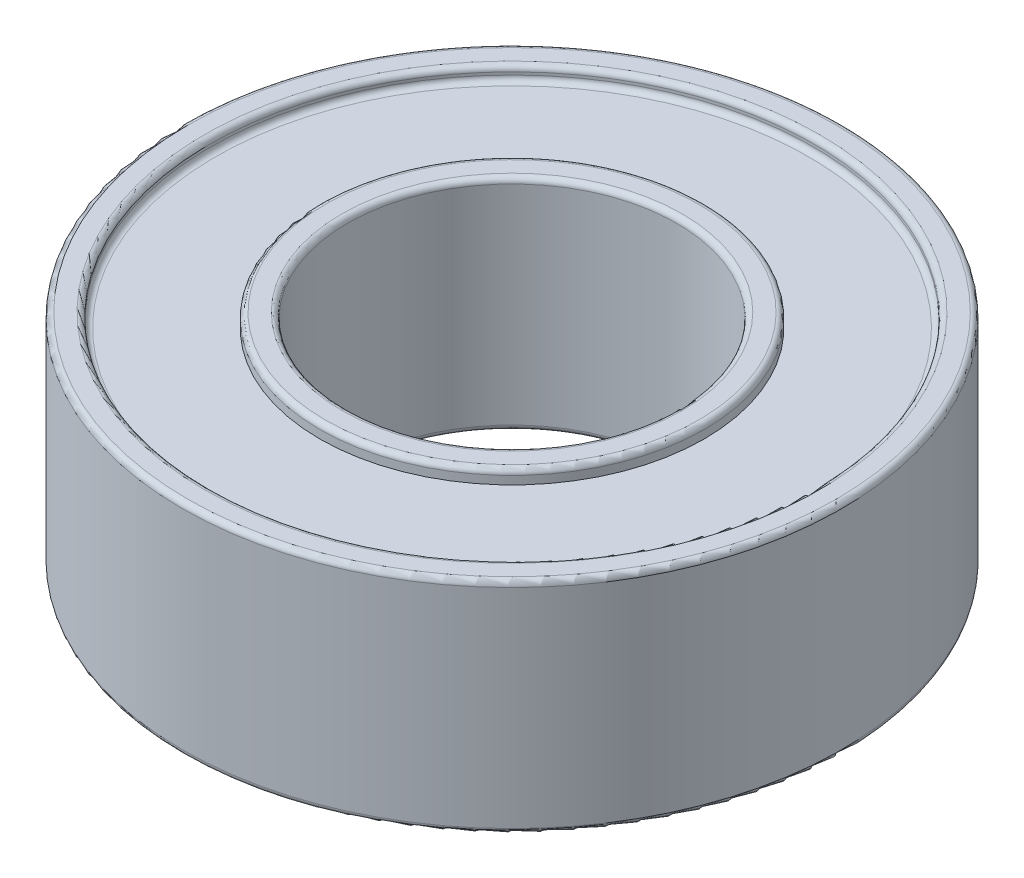
ISO-10303-21;
HEADER;
FILE_DESCRIPTION(('STEP AP214'),'2;1');
FILE_NAME('part.step','',(''),(''),'','','');
FILE_SCHEMA(('AUTOMOTIVE_DESIGN { 1 0 10303 214 1 1 1 1 }'));
ENDSEC;
DATA;
#1=APPLICATION_CONTEXT('core data for automotive mechanical design processes');
#2=APPLICATION_PROTOCOL_DEFINITION('international standard','automotive_design',2000,#1);
#3=PRODUCT_CONTEXT('',#1,'mechanical');
#4=PRODUCT('Part','Part','',(#3));
#5=PRODUCT_RELATED_PRODUCT_CATEGORY('part','',(#4));
#6=PRODUCT_DEFINITION_FORMATION('','',#4);
#7=PRODUCT_DEFINITION_CONTEXT('part definition',#1,'design');
#8=PRODUCT_DEFINITION('design','',#6,#7);
#9=PRODUCT_DEFINITION_SHAPE('','',#8);
#10=(LENGTH_UNIT() NAMED_UNIT(*) SI_UNIT(.MILLI.,.METRE.));
#11=(NAMED_UNIT(*) PLANE_ANGLE_UNIT() SI_UNIT($,.RADIAN.));
#12=(NAMED_UNIT(*) SI_UNIT($,.STERADIAN.) SOLID_ANGLE_UNIT());
#13=UNCERTAINTY_MEASURE_WITH_UNIT(LENGTH_MEASURE(1.E-05),#10,'distance_accuracy_value','');
#14=(GEOMETRIC_REPRESENTATION_CONTEXT(3) GLOBAL_UNCERTAINTY_ASSIGNED_CONTEXT((#13)) GLOBAL_UNIT_ASSIGNED_CONTEXT((#10,
#11,#12)) REPRESENTATION_CONTEXT('',''));
#15=CARTESIAN_POINT('',(0.,0.,0.));
#16=DIRECTION('',(0.,0.,1.));
#17=DIRECTION('',(1.,0.,0.));
#18=AXIS2_PLACEMENT_3D('',#15,#16,#17);
#19=CARTESIAN_POINT('',(0.,0.,0.));
#20=DIRECTION('',(0.,1.,0.));
#21=DIRECTION('',(0.,0.,1.));
#22=AXIS2_PLACEMENT_3D('',#19,#20,#21);
#23=PLANE('',#22);
#24=CARTESIAN_POINT('',(0.,0.,0.));
#25=DIRECTION('',(0.,1.,0.));
#26=DIRECTION('',(0.,0.,1.));
#27=AXIS2_PLACEMENT_3D('',#24,#25,#26);
#28=CIRCLE('',#27,3.1);
#29=CARTESIAN_POINT('',(0.,0.,3.1));
#30=VERTEX_POINT('',#29);
#31=EDGE_CURVE('E75',#30,#30,#28,.T.);
#32=ORIENTED_EDGE('',*,*,#31,.T.);
#33=EDGE_LOOP('',(#32));
#34=FACE_BOUND('',#33,.T.);
#35=CARTESIAN_POINT('',(0.,0.,0.));
#36=DIRECTION('',(0.,1.,0.));
#37=DIRECTION('',(0.,0.,1.));
#38=AXIS2_PLACEMENT_3D('',#35,#36,#37);
#39=CIRCLE('',#38,3.4);
#40=CARTESIAN_POINT('',(0.,0.,3.4));
#41=VERTEX_POINT('',#40);
#42=EDGE_CURVE('E78',#41,#41,#39,.F.);
#43=ORIENTED_EDGE('',*,*,#42,.T.);
#44=EDGE_LOOP('',(#43));
#45=FACE_BOUND('',#44,.T.);
#46=ADVANCED_FACE('F34',(#34,#45),#23,.F.);
#47=CARTESIAN_POINT('',(0.,4.,0.));
#48=DIRECTION('',(0.,1.,0.));
#49=DIRECTION('',(0.,0.,1.));
#50=AXIS2_PLACEMENT_3D('',#47,#48,#49);
#51=PLANE('',#50);
#52=CARTESIAN_POINT('',(0.,4.,0.));
#53=DIRECTION('',(0.,1.,0.));
#54=DIRECTION('',(0.,0.,1.));
#55=AXIS2_PLACEMENT_3D('',#52,#53,#54);
#56=CIRCLE('',#55,3.4);
#57=CARTESIAN_POINT('',(0.,4.,3.4));
#58=VERTEX_POINT('',#57);
#59=EDGE_CURVE('E60',#58,#58,#56,.T.);
#60=ORIENTED_EDGE('',*,*,#59,.T.);
#61=EDGE_LOOP('',(#60));
#62=FACE_BOUND('',#61,.T.);
#63=CARTESIAN_POINT('',(0.,4.,0.));
#64=DIRECTION('',(0.,1.,0.));
#65=DIRECTION('',(0.,0.,1.));
#66=AXIS2_PLACEMENT_3D('',#63,#64,#65);
#67=CIRCLE('',#66,3.1);
#68=CARTESIAN_POINT('',(0.,4.,3.1));
#69=VERTEX_POINT('',#68);
#70=EDGE_CURVE('E63',#69,#69,#67,.F.);
#71=ORIENTED_EDGE('',*,*,#70,.T.);
#72=EDGE_LOOP('',(#71));
#73=FACE_BOUND('',#72,.T.);
#74=ADVANCED_FACE('F124',(#62,#73),#51,.T.);
#75=CARTESIAN_POINT('',(0.,4.,0.));
#76=DIRECTION('',(0.,1.,0.));
#77=DIRECTION('',(0.,0.,1.));
#78=AXIS2_PLACEMENT_3D('',#75,#76,#77);
#79=CIRCLE('',#78,5.6);
#80=CARTESIAN_POINT('',(0.,4.,5.6));
#81=VERTEX_POINT('',#80);
#82=EDGE_CURVE('E84',#81,#81,#79,.F.);
#83=ORIENTED_EDGE('',*,*,#82,.T.);
#84=EDGE_LOOP('',(#83));
#85=FACE_BOUND('',#84,.T.);
#86=CARTESIAN_POINT('',(0.,4.,0.));
#87=DIRECTION('',(0.,1.,0.));
#88=DIRECTION('',(0.,0.,1.));
#89=AXIS2_PLACEMENT_3D('',#86,#87,#88);
#90=CIRCLE('',#89,5.9);
#91=CARTESIAN_POINT('',(0.,4.,5.9));
#92=VERTEX_POINT('',#91);
#93=EDGE_CURVE('E87',#92,#92,#90,.T.);
#94=ORIENTED_EDGE('',*,*,#93,.T.);
#95=EDGE_LOOP('',(#94));
#96=FACE_BOUND('',#95,.T.);
#97=ADVANCED_FACE('F131',(#85,#96),#51,.T.);
#98=CARTESIAN_POINT('',(0.,0.,0.));
#99=DIRECTION('',(0.,1.,0.));
#100=DIRECTION('',(0.,0.,1.));
#101=AXIS2_PLACEMENT_3D('',#98,#99,#100);
#102=CIRCLE('',#101,5.9);
#103=CARTESIAN_POINT('',(0.,0.,5.9));
#104=VERTEX_POINT('',#103);
#105=EDGE_CURVE('E45',#104,#104,#102,.F.);
#106=ORIENTED_EDGE('',*,*,#105,.T.);
#107=EDGE_LOOP('',(#106));
#108=FACE_BOUND('',#107,.T.);
#109=CARTESIAN_POINT('',(0.,0.,0.));
#110=DIRECTION('',(0.,1.,0.));
#111=DIRECTION('',(0.,0.,1.));
#112=AXIS2_PLACEMENT_3D('',#109,#110,#111);
#113=CIRCLE('',#112,5.5);
#114=CARTESIAN_POINT('',(0.,0.,5.5));
#115=VERTEX_POINT('',#114);
#116=EDGE_CURVE('E99',#115,#115,#113,.T.);
#117=ORIENTED_EDGE('',*,*,#116,.T.);
#118=EDGE_LOOP('',(#117));
#119=FACE_BOUND('',#118,.T.);
#120=ADVANCED_FACE('F127',(#108,#119),#23,.F.);
#121=CARTESIAN_POINT('',(0.,4.,0.));
#122=DIRECTION('',(0.,-1.,0.));
#123=DIRECTION('',(0.,0.,-1.));
#124=AXIS2_PLACEMENT_3D('',#121,#122,#123);
#125=CYLINDRICAL_SURFACE('',#124,6.);
#126=CARTESIAN_POINT('',(0.,0.0999999999999998,0.));
#127=DIRECTION('',(0.,1.,0.));
#128=DIRECTION('',(0.,0.,1.));
#129=AXIS2_PLACEMENT_3D('',#126,#127,#128);
#130=CIRCLE('',#129,6.);
#131=CARTESIAN_POINT('',(0.,0.0999999999999998,6.));
#132=VERTEX_POINT('',#131);
#133=EDGE_CURVE('E49',#132,#132,#130,.T.);
#134=ORIENTED_EDGE('',*,*,#133,.T.);
#135=EDGE_LOOP('',(#134));
#136=FACE_BOUND('',#135,.T.);
#137=CARTESIAN_POINT('',(0.,3.9,0.));
#138=DIRECTION('',(0.,1.,0.));
#139=DIRECTION('',(0.,0.,1.));
#140=AXIS2_PLACEMENT_3D('',#137,#138,#139);
#141=CIRCLE('',#140,6.);
#142=CARTESIAN_POINT('',(0.,3.9,6.));
#143=VERTEX_POINT('',#142);
#144=EDGE_CURVE('E54',#143,#143,#141,.F.);
#145=ORIENTED_EDGE('',*,*,#144,.T.);
#146=EDGE_LOOP('',(#145));
#147=FACE_BOUND('',#146,.T.);
#148=ADVANCED_FACE('F137',(#136,#147),#125,.T.);
#149=CARTESIAN_POINT('',(0.,4.,0.));
#150=DIRECTION('',(0.,-1.,0.));
#151=DIRECTION('',(0.,0.,-1.));
#152=AXIS2_PLACEMENT_3D('',#149,#150,#151);
#153=CYLINDRICAL_SURFACE('',#152,3.);
#154=CARTESIAN_POINT('',(0.,0.0999999999999998,0.));
#155=DIRECTION('',(0.,1.,0.));
#156=DIRECTION('',(0.,0.,1.));
#157=AXIS2_PLACEMENT_3D('',#154,#155,#156);
#158=CIRCLE('',#157,3.);
#159=CARTESIAN_POINT('',(0.,0.0999999999999998,3.));
#160=VERTEX_POINT('',#159);
#161=EDGE_CURVE('E69',#160,#160,#158,.F.);
#162=ORIENTED_EDGE('',*,*,#161,.T.);
#163=EDGE_LOOP('',(#162));
#164=FACE_BOUND('',#163,.T.);
#165=CARTESIAN_POINT('',(0.,3.9,0.));
#166=DIRECTION('',(0.,1.,0.));
#167=DIRECTION('',(0.,0.,1.));
#168=AXIS2_PLACEMENT_3D('',#165,#166,#167);
#169=CIRCLE('',#168,3.);
#170=CARTESIAN_POINT('',(0.,3.9,3.));
#171=VERTEX_POINT('',#170);
#172=EDGE_CURVE('E72',#171,#171,#169,.T.);
#173=ORIENTED_EDGE('',*,*,#172,.T.);
#174=EDGE_LOOP('',(#173));
#175=FACE_BOUND('',#174,.T.);
#176=ADVANCED_FACE('F143',(#164,#175),#153,.F.);
#177=CARTESIAN_POINT('',(0.,3.75,0.));
#178=DIRECTION('',(0.,1.,0.));
#179=DIRECTION('',(0.,0.,1.));
#180=AXIS2_PLACEMENT_3D('',#177,#178,#179);
#181=CYLINDRICAL_SURFACE('',#180,5.5);
#182=CARTESIAN_POINT('',(0.,3.9,0.));
#183=DIRECTION('',(0.,1.,0.));
#184=DIRECTION('',(0.,0.,1.));
#185=AXIS2_PLACEMENT_3D('',#182,#183,#184);
#186=CIRCLE('',#185,5.5);
#187=CARTESIAN_POINT('',(0.,3.9,5.5));
#188=VERTEX_POINT('',#187);
#189=EDGE_CURVE('E90',#188,#188,#186,.T.);
#190=ORIENTED_EDGE('',*,*,#189,.T.);
#191=EDGE_LOOP('',(#190));
#192=FACE_BOUND('',#191,.T.);
#193=CARTESIAN_POINT('',(0.,3.85,0.));
#194=DIRECTION('',(0.,1.,0.));
#195=DIRECTION('',(0.,0.,1.));
#196=AXIS2_PLACEMENT_3D('',#193,#194,#195);
#197=CIRCLE('',#196,5.5);
#198=CARTESIAN_POINT('',(0.,3.85,5.5));
#199=VERTEX_POINT('',#198);
#200=EDGE_CURVE('E93',#199,#199,#197,.F.);
#201=ORIENTED_EDGE('',*,*,#200,.T.);
#202=EDGE_LOOP('',(#201));
#203=FACE_BOUND('',#202,.T.);
#204=ADVANCED_FACE('F200',(#192,#203),#181,.F.);
#205=CARTESIAN_POINT('',(0.,3.75,0.));
#206=DIRECTION('',(0.,1.,0.));
#207=DIRECTION('',(0.,0.,1.));
#208=AXIS2_PLACEMENT_3D('',#205,#206,#207);
#209=PLANE('',#208);
#210=CARTESIAN_POINT('',(0.,3.75,0.));
#211=DIRECTION('',(0.,1.,0.));
#212=DIRECTION('',(0.,0.,1.));
#213=AXIS2_PLACEMENT_3D('',#210,#211,#212);
#214=CIRCLE('',#213,5.4);
#215=CARTESIAN_POINT('',(0.,3.75,5.4));
#216=VERTEX_POINT('',#215);
#217=EDGE_CURVE('E81',#216,#216,#214,.T.);
#218=ORIENTED_EDGE('',*,*,#217,.T.);
#219=EDGE_LOOP('',(#218));
#220=FACE_BOUND('',#219,.T.);
#221=CARTESIAN_POINT('',(0.,3.75,0.));
#222=DIRECTION('',(0.,1.,0.));
#223=DIRECTION('',(0.,0.,1.));
#224=AXIS2_PLACEMENT_3D('',#221,#222,#223);
#225=CIRCLE('',#224,3.5);
#226=CARTESIAN_POINT('',(0.,3.75,3.5));
#227=VERTEX_POINT('',#226);
#228=EDGE_CURVE('E96',#227,#227,#225,.T.);
#229=ORIENTED_EDGE('',*,*,#228,.F.);
#230=EDGE_LOOP('',(#229));
#231=FACE_BOUND('',#230,.T.);
#232=ADVANCED_FACE('F196',(#220,#231),#209,.T.);
#233=CARTESIAN_POINT('',(0.,3.75,0.));
#234=DIRECTION('',(0.,1.,0.));
#235=DIRECTION('',(0.,0.,1.));
#236=AXIS2_PLACEMENT_3D('',#233,#234,#235);
#237=CYLINDRICAL_SURFACE('',#236,3.5);
#238=CARTESIAN_POINT('',(0.,3.9,0.));
#239=DIRECTION('',(0.,1.,0.));
#240=DIRECTION('',(0.,0.,1.));
#241=AXIS2_PLACEMENT_3D('',#238,#239,#240);
#242=CIRCLE('',#241,3.5);
#243=CARTESIAN_POINT('',(0.,3.9,3.5));
#244=VERTEX_POINT('',#243);
#245=EDGE_CURVE('E57',#244,#244,#242,.F.);
#246=ORIENTED_EDGE('',*,*,#245,.T.);
#247=EDGE_LOOP('',(#246));
#248=FACE_BOUND('',#247,.T.);
#249=ORIENTED_EDGE('',*,*,#228,.T.);
#250=EDGE_LOOP('',(#249));
#251=FACE_BOUND('',#250,.T.);
#252=ADVANCED_FACE('F199',(#248,#251),#237,.T.);
#253=CARTESIAN_POINT('',(0.,0.25,0.));
#254=DIRECTION('',(0.,-1.,0.));
#255=DIRECTION('',(0.,0.,1.));
#256=AXIS2_PLACEMENT_3D('',#253,#254,#255);
#257=PLANE('',#256);
#258=CARTESIAN_POINT('',(0.,0.25,0.));
#259=DIRECTION('',(0.,-1.,0.));
#260=DIRECTION('',(0.,0.,-1.));
#261=AXIS2_PLACEMENT_3D('',#258,#259,#260);
#262=CIRCLE('',#261,5.4);
#263=CARTESIAN_POINT('',(0.,0.25,-5.4));
#264=VERTEX_POINT('',#263);
#265=EDGE_CURVE('E10',#264,#264,#262,.T.);
#266=ORIENTED_EDGE('',*,*,#265,.T.);
#267=EDGE_LOOP('',(#266));
#268=FACE_BOUND('',#267,.T.);
#269=CARTESIAN_POINT('',(0.,0.25,0.));
#270=DIRECTION('',(0.,1.,0.));
#271=DIRECTION('',(0.,0.,1.));
#272=AXIS2_PLACEMENT_3D('',#269,#270,#271);
#273=CIRCLE('',#272,3.5);
#274=CARTESIAN_POINT('',(0.,0.25,3.5));
#275=VERTEX_POINT('',#274);
#276=EDGE_CURVE('E102',#275,#275,#273,.T.);
#277=ORIENTED_EDGE('',*,*,#276,.T.);
#278=EDGE_LOOP('',(#277));
#279=FACE_BOUND('',#278,.T.);
#280=ADVANCED_FACE('F106',(#268,#279),#257,.T.);
#281=CARTESIAN_POINT('',(0.,0.25,0.));
#282=DIRECTION('',(0.,-1.,0.));
#283=DIRECTION('',(0.,0.,-1.));
#284=AXIS2_PLACEMENT_3D('',#281,#282,#283);
#285=CYLINDRICAL_SURFACE('',#284,5.5);
#286=CARTESIAN_POINT('',(0.,0.15,0.));
#287=DIRECTION('',(0.,-1.,0.));
#288=DIRECTION('',(0.,0.,-1.));
#289=AXIS2_PLACEMENT_3D('',#286,#287,#288);
#290=CIRCLE('',#289,5.5);
#291=CARTESIAN_POINT('',(0.,0.15,-5.5));
#292=VERTEX_POINT('',#291);
#293=EDGE_CURVE('E41',#292,#292,#290,.F.);
#294=ORIENTED_EDGE('',*,*,#293,.T.);
#295=EDGE_LOOP('',(#294));
#296=FACE_BOUND('',#295,.T.);
#297=ORIENTED_EDGE('',*,*,#116,.F.);
#298=EDGE_LOOP('',(#297));
#299=FACE_BOUND('',#298,.T.);
#300=ADVANCED_FACE('F111',(#296,#299),#285,.F.);
#301=CARTESIAN_POINT('',(0.,0.25,0.));
#302=DIRECTION('',(0.,-1.,0.));
#303=DIRECTION('',(0.,0.,-1.));
#304=AXIS2_PLACEMENT_3D('',#301,#302,#303);
#305=CYLINDRICAL_SURFACE('',#304,3.5);
#306=CARTESIAN_POINT('',(0.,0.1,0.));
#307=DIRECTION('',(0.,1.,0.));
#308=DIRECTION('',(0.,0.,1.));
#309=AXIS2_PLACEMENT_3D('',#306,#307,#308);
#310=CIRCLE('',#309,3.5);
#311=CARTESIAN_POINT('',(0.,0.1,3.5));
#312=VERTEX_POINT('',#311);
#313=EDGE_CURVE('E66',#312,#312,#310,.T.);
#314=ORIENTED_EDGE('',*,*,#313,.T.);
#315=EDGE_LOOP('',(#314));
#316=FACE_BOUND('',#315,.T.);
#317=ORIENTED_EDGE('',*,*,#276,.F.);
#318=EDGE_LOOP('',(#317));
#319=FACE_BOUND('',#318,.T.);
#320=ADVANCED_FACE('F108',(#316,#319),#305,.T.);
#321=CARTESIAN_POINT('',(0.,3.9,0.));
#322=DIRECTION('',(0.,1.,0.));
#323=DIRECTION('',(0.,0.,1.));
#324=AXIS2_PLACEMENT_3D('',#321,#322,#323);
#325=TOROIDAL_SURFACE('',#324,5.6,0.1);
#326=ORIENTED_EDGE('',*,*,#82,.F.);
#327=EDGE_LOOP('',(#326));
#328=FACE_BOUND('',#327,.T.);
#329=ORIENTED_EDGE('',*,*,#189,.F.);
#330=EDGE_LOOP('',(#329));
#331=FACE_BOUND('',#330,.T.);
#332=ADVANCED_FACE('F110',(#328,#331),#325,.T.);
#333=CARTESIAN_POINT('',(0.,3.85,0.));
#334=DIRECTION('',(0.,1.,0.));
#335=DIRECTION('',(0.,0.,1.));
#336=AXIS2_PLACEMENT_3D('',#333,#334,#335);
#337=TOROIDAL_SURFACE('',#336,5.4,0.1);
#338=ORIENTED_EDGE('',*,*,#200,.F.);
#339=EDGE_LOOP('',(#338));
#340=FACE_BOUND('',#339,.T.);
#341=ORIENTED_EDGE('',*,*,#217,.F.);
#342=EDGE_LOOP('',(#341));
#343=FACE_BOUND('',#342,.T.);
#344=ADVANCED_FACE('F118',(#340,#343),#337,.F.);
#345=CARTESIAN_POINT('',(0.,0.0999999999999998,0.));
#346=DIRECTION('',(0.,1.,0.));
#347=DIRECTION('',(0.,0.,1.));
#348=AXIS2_PLACEMENT_3D('',#345,#346,#347);
#349=TOROIDAL_SURFACE('',#348,3.1,0.1);
#350=ORIENTED_EDGE('',*,*,#161,.F.);
#351=EDGE_LOOP('',(#350));
#352=FACE_BOUND('',#351,.T.);
#353=ORIENTED_EDGE('',*,*,#31,.F.);
#354=EDGE_LOOP('',(#353));
#355=FACE_BOUND('',#354,.T.);
#356=ADVANCED_FACE('F183',(#352,#355),#349,.T.);
#357=CARTESIAN_POINT('',(0.,0.1,0.));
#358=DIRECTION('',(0.,1.,0.));
#359=DIRECTION('',(0.,0.,1.));
#360=AXIS2_PLACEMENT_3D('',#357,#358,#359);
#361=TOROIDAL_SURFACE('',#360,3.4,0.1);
#362=ORIENTED_EDGE('',*,*,#42,.F.);
#363=EDGE_LOOP('',(#362));
#364=FACE_BOUND('',#363,.T.);
#365=ORIENTED_EDGE('',*,*,#313,.F.);
#366=EDGE_LOOP('',(#365));
#367=FACE_BOUND('',#366,.T.);
#368=ADVANCED_FACE('F179',(#364,#367),#361,.T.);
#369=CARTESIAN_POINT('',(0.,3.9,0.));
#370=DIRECTION('',(0.,1.,0.));
#371=DIRECTION('',(0.,0.,1.));
#372=AXIS2_PLACEMENT_3D('',#369,#370,#371);
#373=TOROIDAL_SURFACE('',#372,3.4,0.1);
#374=ORIENTED_EDGE('',*,*,#245,.F.);
#375=EDGE_LOOP('',(#374));
#376=FACE_BOUND('',#375,.T.);
#377=ORIENTED_EDGE('',*,*,#59,.F.);
#378=EDGE_LOOP('',(#377));
#379=FACE_BOUND('',#378,.T.);
#380=ADVANCED_FACE('F175',(#376,#379),#373,.T.);
#381=CARTESIAN_POINT('',(0.,3.9,0.));
#382=DIRECTION('',(0.,1.,0.));
#383=DIRECTION('',(0.,0.,1.));
#384=AXIS2_PLACEMENT_3D('',#381,#382,#383);
#385=TOROIDAL_SURFACE('',#384,3.1,0.1);
#386=ORIENTED_EDGE('',*,*,#70,.F.);
#387=EDGE_LOOP('',(#386));
#388=FACE_BOUND('',#387,.T.);
#389=ORIENTED_EDGE('',*,*,#172,.F.);
#390=EDGE_LOOP('',(#389));
#391=FACE_BOUND('',#390,.T.);
#392=ADVANCED_FACE('F155',(#388,#391),#385,.T.);
#393=CARTESIAN_POINT('',(0.,0.0999999999999998,0.));
#394=DIRECTION('',(0.,1.,0.));
#395=DIRECTION('',(0.,0.,1.));
#396=AXIS2_PLACEMENT_3D('',#393,#394,#395);
#397=TOROIDAL_SURFACE('',#396,5.9,0.1);
#398=ORIENTED_EDGE('',*,*,#105,.F.);
#399=EDGE_LOOP('',(#398));
#400=FACE_BOUND('',#399,.T.);
#401=ORIENTED_EDGE('',*,*,#133,.F.);
#402=EDGE_LOOP('',(#401));
#403=FACE_BOUND('',#402,.T.);
#404=ADVANCED_FACE('F151',(#400,#403),#397,.T.);
#405=CARTESIAN_POINT('',(0.,0.15,0.));
#406=DIRECTION('',(0.,-1.,0.));
#407=DIRECTION('',(0.,0.,-1.));
#408=AXIS2_PLACEMENT_3D('',#405,#406,#407);
#409=TOROIDAL_SURFACE('',#408,5.4,0.1);
#410=ORIENTED_EDGE('',*,*,#265,.F.);
#411=EDGE_LOOP('',(#410));
#412=FACE_BOUND('',#411,.T.);
#413=ORIENTED_EDGE('',*,*,#293,.F.);
#414=EDGE_LOOP('',(#413));
#415=FACE_BOUND('',#414,.T.);
#416=ADVANCED_FACE('F154',(#412,#415),#409,.F.);
#417=CARTESIAN_POINT('',(0.,3.9,0.));
#418=DIRECTION('',(0.,1.,0.));
#419=DIRECTION('',(0.,0.,1.));
#420=AXIS2_PLACEMENT_3D('',#417,#418,#419);
#421=TOROIDAL_SURFACE('',#420,5.9,0.1);
#422=ORIENTED_EDGE('',*,*,#144,.F.);
#423=EDGE_LOOP('',(#422));
#424=FACE_BOUND('',#423,.T.);
#425=ORIENTED_EDGE('',*,*,#93,.F.);
#426=EDGE_LOOP('',(#425));
#427=FACE_BOUND('',#426,.T.);
#428=ADVANCED_FACE('F36',(#424,#427),#421,.T.);
#429=CLOSED_SHELL('',(#46,#74,#97,#120,#148,#176,#204,#232,#252,#280,#300,#320,#332,#344,#356,
#368,#380,#392,#404,#416,#428));
#430=MANIFOLD_SOLID_BREP('B2',#429);
#431=ADVANCED_BREP_SHAPE_REPRESENTATION('',(#18,#430),#14);
#432=SHAPE_DEFINITION_REPRESENTATION(#9,#431);
ENDSEC;
END-ISO-10303-21;
